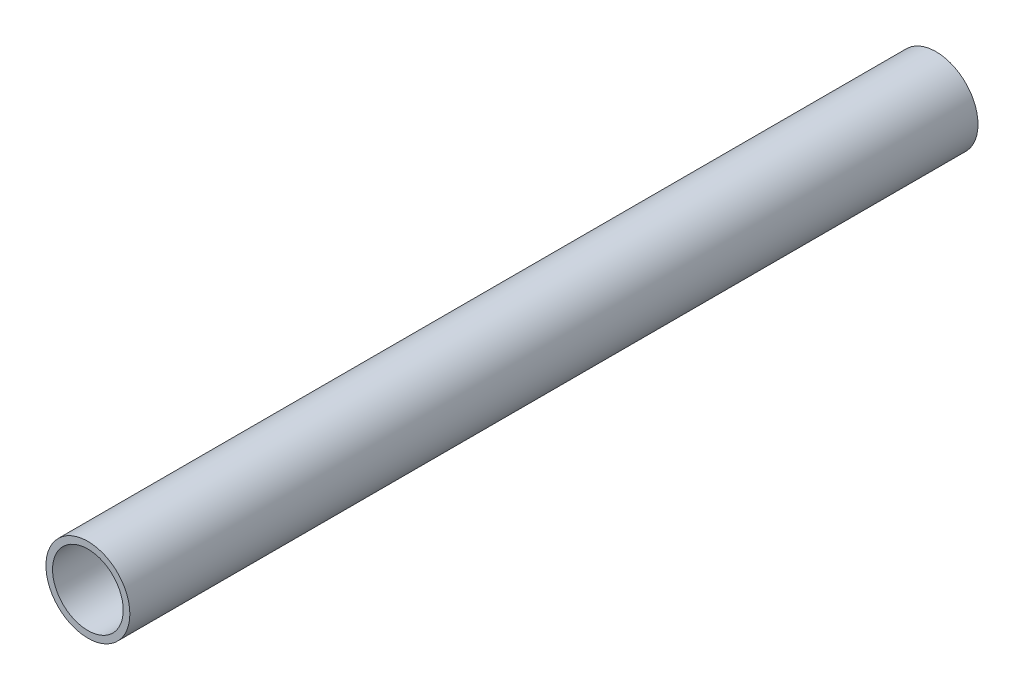
ISO-10303-21;
HEADER;
FILE_DESCRIPTION(('STEP AP214'),'2;1');
FILE_NAME('part.step','',(''),(''),'','','');
FILE_SCHEMA(('AUTOMOTIVE_DESIGN { 1 0 10303 214 1 1 1 1 }'));
ENDSEC;
DATA;
#1=APPLICATION_CONTEXT('core data for automotive mechanical design processes');
#2=APPLICATION_PROTOCOL_DEFINITION('international standard','automotive_design',2000,#1);
#3=PRODUCT_CONTEXT('',#1,'mechanical');
#4=PRODUCT('Part','Part','',(#3));
#5=PRODUCT_RELATED_PRODUCT_CATEGORY('part','',(#4));
#6=PRODUCT_DEFINITION_FORMATION('','',#4);
#7=PRODUCT_DEFINITION_CONTEXT('part definition',#1,'design');
#8=PRODUCT_DEFINITION('design','',#6,#7);
#9=PRODUCT_DEFINITION_SHAPE('','',#8);
#10=(LENGTH_UNIT() NAMED_UNIT(*) SI_UNIT(.MILLI.,.METRE.));
#11=(NAMED_UNIT(*) PLANE_ANGLE_UNIT() SI_UNIT($,.RADIAN.));
#12=(NAMED_UNIT(*) SI_UNIT($,.STERADIAN.) SOLID_ANGLE_UNIT());
#13=UNCERTAINTY_MEASURE_WITH_UNIT(LENGTH_MEASURE(1.E-05),#10,'distance_accuracy_value','');
#14=(GEOMETRIC_REPRESENTATION_CONTEXT(3) GLOBAL_UNCERTAINTY_ASSIGNED_CONTEXT((#13)) GLOBAL_UNIT_ASSIGNED_CONTEXT((#10,
#11,#12)) REPRESENTATION_CONTEXT('',''));
#15=CARTESIAN_POINT('',(0.,0.,0.));
#16=DIRECTION('',(0.,0.,1.));
#17=DIRECTION('',(1.,0.,0.));
#18=AXIS2_PLACEMENT_3D('',#15,#16,#17);
#19=CARTESIAN_POINT('',(0.,0.,304.8));
#20=DIRECTION('',(0.,0.,1.));
#21=DIRECTION('',(1.,0.,0.));
#22=AXIS2_PLACEMENT_3D('',#19,#20,#21);
#23=PLANE('',#22);
#24=CARTESIAN_POINT('',(0.,0.,304.8));
#25=DIRECTION('',(0.,0.,1.));
#26=DIRECTION('',(1.,0.,0.));
#27=AXIS2_PLACEMENT_3D('',#24,#25,#26);
#28=CIRCLE('',#27,30.1625);
#29=CARTESIAN_POINT('',(30.1625,0.,304.8));
#30=VERTEX_POINT('',#29);
#31=EDGE_CURVE('E10',#30,#30,#28,.T.);
#32=ORIENTED_EDGE('',*,*,#31,.T.);
#33=EDGE_LOOP('',(#32));
#34=FACE_BOUND('',#33,.T.);
#35=CARTESIAN_POINT('',(0.,0.,304.8));
#36=DIRECTION('',(0.,0.,1.));
#37=DIRECTION('',(1.,0.,0.));
#38=AXIS2_PLACEMENT_3D('',#35,#36,#37);
#39=CIRCLE('',#38,25.4);
#40=CARTESIAN_POINT('',(25.4,0.,304.8));
#41=VERTEX_POINT('',#40);
#42=EDGE_CURVE('E41',#41,#41,#39,.T.);
#43=ORIENTED_EDGE('',*,*,#42,.F.);
#44=EDGE_LOOP('',(#43));
#45=FACE_BOUND('',#44,.T.);
#46=ADVANCED_FACE('F30',(#34,#45),#23,.T.);
#47=CARTESIAN_POINT('',(0.,0.,-304.8));
#48=DIRECTION('',(0.,0.,1.));
#49=DIRECTION('',(1.,0.,0.));
#50=AXIS2_PLACEMENT_3D('',#47,#48,#49);
#51=PLANE('',#50);
#52=CARTESIAN_POINT('',(0.,0.,-304.8));
#53=DIRECTION('',(0.,0.,1.));
#54=DIRECTION('',(1.,0.,0.));
#55=AXIS2_PLACEMENT_3D('',#52,#53,#54);
#56=CIRCLE('',#55,30.1625);
#57=CARTESIAN_POINT('',(30.1625,0.,-304.8));
#58=VERTEX_POINT('',#57);
#59=EDGE_CURVE('E34',#58,#58,#56,.T.);
#60=ORIENTED_EDGE('',*,*,#59,.F.);
#61=EDGE_LOOP('',(#60));
#62=FACE_BOUND('',#61,.T.);
#63=CARTESIAN_POINT('',(0.,0.,-304.8));
#64=DIRECTION('',(0.,0.,1.));
#65=DIRECTION('',(1.,0.,0.));
#66=AXIS2_PLACEMENT_3D('',#63,#64,#65);
#67=CIRCLE('',#66,25.4);
#68=CARTESIAN_POINT('',(25.4,0.,-304.8));
#69=VERTEX_POINT('',#68);
#70=EDGE_CURVE('E43',#69,#69,#67,.T.);
#71=ORIENTED_EDGE('',*,*,#70,.T.);
#72=EDGE_LOOP('',(#71));
#73=FACE_BOUND('',#72,.T.);
#74=ADVANCED_FACE('F53',(#62,#73),#51,.F.);
#75=CARTESIAN_POINT('',(0.,0.,304.8));
#76=DIRECTION('',(0.,0.,-1.));
#77=DIRECTION('',(-1.,0.,0.));
#78=AXIS2_PLACEMENT_3D('',#75,#76,#77);
#79=CYLINDRICAL_SURFACE('',#78,30.1625);
#80=ORIENTED_EDGE('',*,*,#31,.F.);
#81=EDGE_LOOP('',(#80));
#82=FACE_BOUND('',#81,.T.);
#83=ORIENTED_EDGE('',*,*,#59,.T.);
#84=EDGE_LOOP('',(#83));
#85=FACE_BOUND('',#84,.T.);
#86=ADVANCED_FACE('F32',(#82,#85),#79,.T.);
#87=CARTESIAN_POINT('',(0.,0.,304.8));
#88=DIRECTION('',(0.,0.,-1.));
#89=DIRECTION('',(-1.,0.,0.));
#90=AXIS2_PLACEMENT_3D('',#87,#88,#89);
#91=CYLINDRICAL_SURFACE('',#90,25.4);
#92=ORIENTED_EDGE('',*,*,#42,.T.);
#93=EDGE_LOOP('',(#92));
#94=FACE_BOUND('',#93,.T.);
#95=ORIENTED_EDGE('',*,*,#70,.F.);
#96=EDGE_LOOP('',(#95));
#97=FACE_BOUND('',#96,.T.);
#98=ADVANCED_FACE('F49',(#94,#97),#91,.F.);
#99=CLOSED_SHELL('',(#46,#74,#86,#98));
#100=MANIFOLD_SOLID_BREP('B2',#99);
#101=ADVANCED_BREP_SHAPE_REPRESENTATION('',(#18,#100),#14);
#102=SHAPE_DEFINITION_REPRESENTATION(#9,#101);
ENDSEC;
END-ISO-10303-21;
